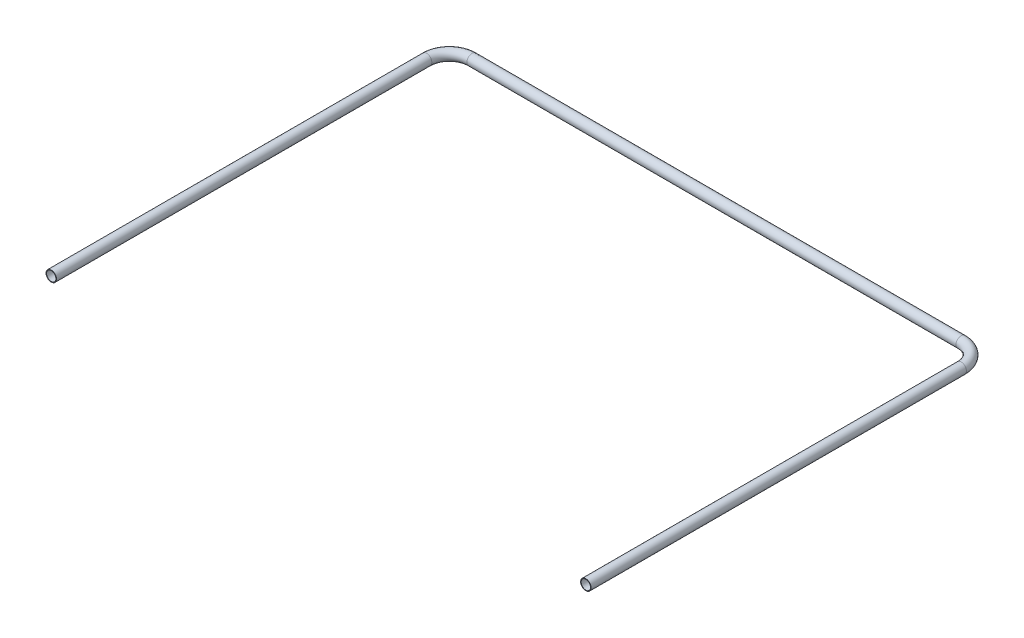
ISO-10303-21;
HEADER;
FILE_DESCRIPTION(('STEP AP214'),'2;1');
FILE_NAME('part.step','',(''),(''),'','','');
FILE_SCHEMA(('AUTOMOTIVE_DESIGN { 1 0 10303 214 1 1 1 1 }'));
ENDSEC;
DATA;
#1=APPLICATION_CONTEXT('core data for automotive mechanical design processes');
#2=APPLICATION_PROTOCOL_DEFINITION('international standard','automotive_design',2000,#1);
#3=PRODUCT_CONTEXT('',#1,'mechanical');
#4=PRODUCT('Part','Part','',(#3));
#5=PRODUCT_RELATED_PRODUCT_CATEGORY('part','',(#4));
#6=PRODUCT_DEFINITION_FORMATION('','',#4);
#7=PRODUCT_DEFINITION_CONTEXT('part definition',#1,'design');
#8=PRODUCT_DEFINITION('design','',#6,#7);
#9=PRODUCT_DEFINITION_SHAPE('','',#8);
#10=(LENGTH_UNIT() NAMED_UNIT(*) SI_UNIT(.MILLI.,.METRE.));
#11=(NAMED_UNIT(*) PLANE_ANGLE_UNIT() SI_UNIT($,.RADIAN.));
#12=(NAMED_UNIT(*) SI_UNIT($,.STERADIAN.) SOLID_ANGLE_UNIT());
#13=UNCERTAINTY_MEASURE_WITH_UNIT(LENGTH_MEASURE(1.E-05),#10,'distance_accuracy_value','');
#14=(GEOMETRIC_REPRESENTATION_CONTEXT(3) GLOBAL_UNCERTAINTY_ASSIGNED_CONTEXT((#13)) GLOBAL_UNIT_ASSIGNED_CONTEXT((#10,
#11,#12)) REPRESENTATION_CONTEXT('',''));
#15=CARTESIAN_POINT('',(0.,0.,0.));
#16=DIRECTION('',(0.,0.,1.));
#17=DIRECTION('',(1.,0.,0.));
#18=AXIS2_PLACEMENT_3D('',#15,#16,#17);
#19=CARTESIAN_POINT('',(546.1,0.,-889.));
#20=DIRECTION('',(-1.,0.,0.));
#21=DIRECTION('',(0.,0.,1.));
#22=AXIS2_PLACEMENT_3D('',#19,#20,#21);
#23=CYLINDRICAL_SURFACE('',#22,10.4648);
#24=CARTESIAN_POINT('',(-546.1,0.,-889.));
#25=DIRECTION('',(-1.,0.,0.));
#26=DIRECTION('',(0.,0.,-1.));
#27=AXIS2_PLACEMENT_3D('',#24,#25,#26);
#28=CIRCLE('',#27,10.4648);
#29=CARTESIAN_POINT('',(-546.1,0.,-899.4648));
#30=VERTEX_POINT('',#29);
#31=EDGE_CURVE('E87',#30,#30,#28,.T.);
#32=ORIENTED_EDGE('',*,*,#31,.T.);
#33=EDGE_LOOP('',(#32));
#34=FACE_BOUND('',#33,.T.);
#35=CARTESIAN_POINT('',(546.1,0.,-889.));
#36=DIRECTION('',(-1.,0.,0.));
#37=DIRECTION('',(0.,0.,-1.));
#38=AXIS2_PLACEMENT_3D('',#35,#36,#37);
#39=CIRCLE('',#38,10.4648);
#40=CARTESIAN_POINT('',(546.1,0.,-899.4648));
#41=VERTEX_POINT('',#40);
#42=EDGE_CURVE('E82',#41,#41,#39,.F.);
#43=ORIENTED_EDGE('',*,*,#42,.T.);
#44=EDGE_LOOP('',(#43));
#45=FACE_BOUND('',#44,.T.);
#46=ADVANCED_FACE('F15',(#34,#45),#23,.F.);
#47=CARTESIAN_POINT('',(-546.1,0.,-838.2));
#48=DIRECTION('',(0.,1.,0.));
#49=DIRECTION('',(0.,0.,1.));
#50=AXIS2_PLACEMENT_3D('',#47,#48,#49);
#51=TOROIDAL_SURFACE('',#50,50.8,10.4648);
#52=CARTESIAN_POINT('',(-596.9,0.,-838.2));
#53=DIRECTION('',(0.,0.,1.));
#54=DIRECTION('',(1.,0.,0.));
#55=AXIS2_PLACEMENT_3D('',#52,#53,#54);
#56=CIRCLE('',#55,10.4648);
#57=CARTESIAN_POINT('',(-586.4352,0.,-838.2));
#58=VERTEX_POINT('',#57);
#59=EDGE_CURVE('E80',#58,#58,#56,.T.);
#60=ORIENTED_EDGE('',*,*,#59,.T.);
#61=EDGE_LOOP('',(#60));
#62=FACE_BOUND('',#61,.T.);
#63=ORIENTED_EDGE('',*,*,#31,.F.);
#64=EDGE_LOOP('',(#63));
#65=FACE_BOUND('',#64,.T.);
#66=ADVANCED_FACE('F72',(#62,#65),#51,.F.);
#67=CARTESIAN_POINT('',(546.1,0.,-838.2));
#68=DIRECTION('',(0.,1.,0.));
#69=DIRECTION('',(-1.,0.,0.));
#70=AXIS2_PLACEMENT_3D('',#67,#68,#69);
#71=TOROIDAL_SURFACE('',#70,50.8,10.4648);
#72=ORIENTED_EDGE('',*,*,#42,.F.);
#73=EDGE_LOOP('',(#72));
#74=FACE_BOUND('',#73,.T.);
#75=CARTESIAN_POINT('',(596.9,0.,-838.2));
#76=DIRECTION('',(0.,0.,-1.));
#77=DIRECTION('',(-1.,0.,0.));
#78=AXIS2_PLACEMENT_3D('',#75,#76,#77);
#79=CIRCLE('',#78,10.4648);
#80=CARTESIAN_POINT('',(586.4352,0.,-838.2));
#81=VERTEX_POINT('',#80);
#82=EDGE_CURVE('E78',#81,#81,#79,.F.);
#83=ORIENTED_EDGE('',*,*,#82,.T.);
#84=EDGE_LOOP('',(#83));
#85=FACE_BOUND('',#84,.T.);
#86=ADVANCED_FACE('F68',(#74,#85),#71,.F.);
#87=CARTESIAN_POINT('',(-596.9,0.,-838.2));
#88=DIRECTION('',(0.,0.,1.));
#89=DIRECTION('',(1.,0.,0.));
#90=AXIS2_PLACEMENT_3D('',#87,#88,#89);
#91=CYLINDRICAL_SURFACE('',#90,10.4648);
#92=CARTESIAN_POINT('',(-596.9,0.,0.));
#93=DIRECTION('',(0.,0.,1.));
#94=DIRECTION('',(1.,0.,0.));
#95=AXIS2_PLACEMENT_3D('',#92,#93,#94);
#96=CIRCLE('',#95,10.4648);
#97=CARTESIAN_POINT('',(-586.4352,0.,0.));
#98=VERTEX_POINT('',#97);
#99=EDGE_CURVE('E18',#98,#98,#96,.F.);
#100=ORIENTED_EDGE('',*,*,#99,.F.);
#101=EDGE_LOOP('',(#100));
#102=FACE_BOUND('',#101,.T.);
#103=ORIENTED_EDGE('',*,*,#59,.F.);
#104=EDGE_LOOP('',(#103));
#105=FACE_BOUND('',#104,.T.);
#106=ADVANCED_FACE('F64',(#102,#105),#91,.F.);
#107=CARTESIAN_POINT('',(596.9,0.,0.));
#108=DIRECTION('',(0.,0.,-1.));
#109=DIRECTION('',(-1.,0.,0.));
#110=AXIS2_PLACEMENT_3D('',#107,#108,#109);
#111=CYLINDRICAL_SURFACE('',#110,10.4648);
#112=ORIENTED_EDGE('',*,*,#82,.F.);
#113=EDGE_LOOP('',(#112));
#114=FACE_BOUND('',#113,.T.);
#115=CARTESIAN_POINT('',(596.9,0.,0.));
#116=DIRECTION('',(0.,0.,-1.));
#117=DIRECTION('',(-1.,0.,0.));
#118=AXIS2_PLACEMENT_3D('',#115,#116,#117);
#119=CIRCLE('',#118,10.4648);
#120=CARTESIAN_POINT('',(586.4352,0.,0.));
#121=VERTEX_POINT('',#120);
#122=EDGE_CURVE('E96',#121,#121,#119,.F.);
#123=ORIENTED_EDGE('',*,*,#122,.T.);
#124=EDGE_LOOP('',(#123));
#125=FACE_BOUND('',#124,.T.);
#126=ADVANCED_FACE('F60',(#114,#125),#111,.F.);
#127=CARTESIAN_POINT('',(-596.9,0.,0.));
#128=DIRECTION('',(0.,0.,1.));
#129=DIRECTION('',(1.,0.,0.));
#130=AXIS2_PLACEMENT_3D('',#127,#128,#129);
#131=PLANE('',#130);
#132=ORIENTED_EDGE('',*,*,#99,.T.);
#133=EDGE_LOOP('',(#132));
#134=FACE_BOUND('',#133,.T.);
#135=CARTESIAN_POINT('',(-596.9,0.,0.));
#136=DIRECTION('',(0.,0.,1.));
#137=DIRECTION('',(1.,0.,0.));
#138=AXIS2_PLACEMENT_3D('',#135,#136,#137);
#139=CIRCLE('',#138,11.7094);
#140=CARTESIAN_POINT('',(-585.1906,0.,0.));
#141=VERTEX_POINT('',#140);
#142=EDGE_CURVE('E94',#141,#141,#139,.F.);
#143=ORIENTED_EDGE('',*,*,#142,.F.);
#144=EDGE_LOOP('',(#143));
#145=FACE_BOUND('',#144,.T.);
#146=ADVANCED_FACE('F56',(#134,#145),#131,.T.);
#147=CARTESIAN_POINT('',(596.9,0.,0.));
#148=DIRECTION('',(0.,0.,-1.));
#149=DIRECTION('',(-1.,0.,0.));
#150=AXIS2_PLACEMENT_3D('',#147,#148,#149);
#151=PLANE('',#150);
#152=ORIENTED_EDGE('',*,*,#122,.F.);
#153=EDGE_LOOP('',(#152));
#154=FACE_BOUND('',#153,.T.);
#155=CARTESIAN_POINT('',(596.9,0.,0.));
#156=DIRECTION('',(0.,0.,-1.));
#157=DIRECTION('',(-1.,0.,0.));
#158=AXIS2_PLACEMENT_3D('',#155,#156,#157);
#159=CIRCLE('',#158,11.7094);
#160=CARTESIAN_POINT('',(585.1906,0.,0.));
#161=VERTEX_POINT('',#160);
#162=EDGE_CURVE('E90',#161,#161,#159,.T.);
#163=ORIENTED_EDGE('',*,*,#162,.F.);
#164=EDGE_LOOP('',(#163));
#165=FACE_BOUND('',#164,.T.);
#166=ADVANCED_FACE('F52',(#154,#165),#151,.F.);
#167=CARTESIAN_POINT('',(-596.9,0.,-838.2));
#168=DIRECTION('',(0.,0.,1.));
#169=DIRECTION('',(1.,0.,0.));
#170=AXIS2_PLACEMENT_3D('',#167,#168,#169);
#171=CYLINDRICAL_SURFACE('',#170,11.7094);
#172=ORIENTED_EDGE('',*,*,#142,.T.);
#173=EDGE_LOOP('',(#172));
#174=FACE_BOUND('',#173,.T.);
#175=CARTESIAN_POINT('',(-596.9,0.,-838.2));
#176=DIRECTION('',(0.,0.,1.));
#177=DIRECTION('',(-1.,0.,0.));
#178=AXIS2_PLACEMENT_3D('',#175,#176,#177);
#179=CIRCLE('',#178,11.7094);
#180=CARTESIAN_POINT('',(-608.6094,0.,-838.2));
#181=VERTEX_POINT('',#180);
#182=EDGE_CURVE('E93',#181,#181,#179,.F.);
#183=ORIENTED_EDGE('',*,*,#182,.F.);
#184=EDGE_LOOP('',(#183));
#185=FACE_BOUND('',#184,.T.);
#186=ADVANCED_FACE('F48',(#174,#185),#171,.T.);
#187=CARTESIAN_POINT('',(596.9,0.,0.));
#188=DIRECTION('',(0.,0.,-1.));
#189=DIRECTION('',(-1.,0.,0.));
#190=AXIS2_PLACEMENT_3D('',#187,#188,#189);
#191=CYLINDRICAL_SURFACE('',#190,11.7094);
#192=CARTESIAN_POINT('',(596.9,0.,-838.2));
#193=DIRECTION('',(0.,0.,-1.));
#194=DIRECTION('',(1.,0.,0.));
#195=AXIS2_PLACEMENT_3D('',#192,#193,#194);
#196=CIRCLE('',#195,11.7094);
#197=CARTESIAN_POINT('',(608.6094,0.,-838.2));
#198=VERTEX_POINT('',#197);
#199=EDGE_CURVE('E27',#198,#198,#196,.T.);
#200=ORIENTED_EDGE('',*,*,#199,.F.);
#201=EDGE_LOOP('',(#200));
#202=FACE_BOUND('',#201,.T.);
#203=ORIENTED_EDGE('',*,*,#162,.T.);
#204=EDGE_LOOP('',(#203));
#205=FACE_BOUND('',#204,.T.);
#206=ADVANCED_FACE('F44',(#202,#205),#191,.T.);
#207=CARTESIAN_POINT('',(-546.1,0.,-838.2));
#208=DIRECTION('',(0.,1.,0.));
#209=DIRECTION('',(0.,0.,1.));
#210=AXIS2_PLACEMENT_3D('',#207,#208,#209);
#211=TOROIDAL_SURFACE('',#210,50.8,11.7094);
#212=ORIENTED_EDGE('',*,*,#182,.T.);
#213=EDGE_LOOP('',(#212));
#214=FACE_BOUND('',#213,.T.);
#215=CARTESIAN_POINT('',(-546.1,0.,-889.));
#216=DIRECTION('',(-1.,0.,0.));
#217=DIRECTION('',(0.,0.,1.));
#218=AXIS2_PLACEMENT_3D('',#215,#216,#217);
#219=CIRCLE('',#218,11.7094);
#220=CARTESIAN_POINT('',(-546.1,0.,-877.2906));
#221=VERTEX_POINT('',#220);
#222=EDGE_CURVE('E22',#221,#221,#219,.F.);
#223=ORIENTED_EDGE('',*,*,#222,.F.);
#224=EDGE_LOOP('',(#223));
#225=FACE_BOUND('',#224,.T.);
#226=ADVANCED_FACE('F40',(#214,#225),#211,.T.);
#227=CARTESIAN_POINT('',(546.1,0.,-838.2));
#228=DIRECTION('',(0.,1.,0.));
#229=DIRECTION('',(-1.,0.,0.));
#230=AXIS2_PLACEMENT_3D('',#227,#228,#229);
#231=TOROIDAL_SURFACE('',#230,50.8,11.7094);
#232=CARTESIAN_POINT('',(546.1,0.,-889.));
#233=DIRECTION('',(-1.,0.,0.));
#234=DIRECTION('',(0.,0.,1.));
#235=AXIS2_PLACEMENT_3D('',#232,#233,#234);
#236=CIRCLE('',#235,11.7094);
#237=CARTESIAN_POINT('',(546.1,0.,-877.2906));
#238=VERTEX_POINT('',#237);
#239=EDGE_CURVE('E10',#238,#238,#236,.T.);
#240=ORIENTED_EDGE('',*,*,#239,.F.);
#241=EDGE_LOOP('',(#240));
#242=FACE_BOUND('',#241,.T.);
#243=ORIENTED_EDGE('',*,*,#199,.T.);
#244=EDGE_LOOP('',(#243));
#245=FACE_BOUND('',#244,.T.);
#246=ADVANCED_FACE('F35',(#242,#245),#231,.T.);
#247=CARTESIAN_POINT('',(546.1,0.,-889.));
#248=DIRECTION('',(-1.,0.,0.));
#249=DIRECTION('',(0.,0.,1.));
#250=AXIS2_PLACEMENT_3D('',#247,#248,#249);
#251=CYLINDRICAL_SURFACE('',#250,11.7094);
#252=ORIENTED_EDGE('',*,*,#222,.T.);
#253=EDGE_LOOP('',(#252));
#254=FACE_BOUND('',#253,.T.);
#255=ORIENTED_EDGE('',*,*,#239,.T.);
#256=EDGE_LOOP('',(#255));
#257=FACE_BOUND('',#256,.T.);
#258=ADVANCED_FACE('F39',(#254,#257),#251,.T.);
#259=CLOSED_SHELL('',(#46,#66,#86,#106,#126,#146,#166,#186,#206,#226,#246,#258));
#260=MANIFOLD_SOLID_BREP('B1',#259);
#261=ADVANCED_BREP_SHAPE_REPRESENTATION('',(#18,#260),#14);
#262=SHAPE_DEFINITION_REPRESENTATION(#9,#261);
ENDSEC;
END-ISO-10303-21;
